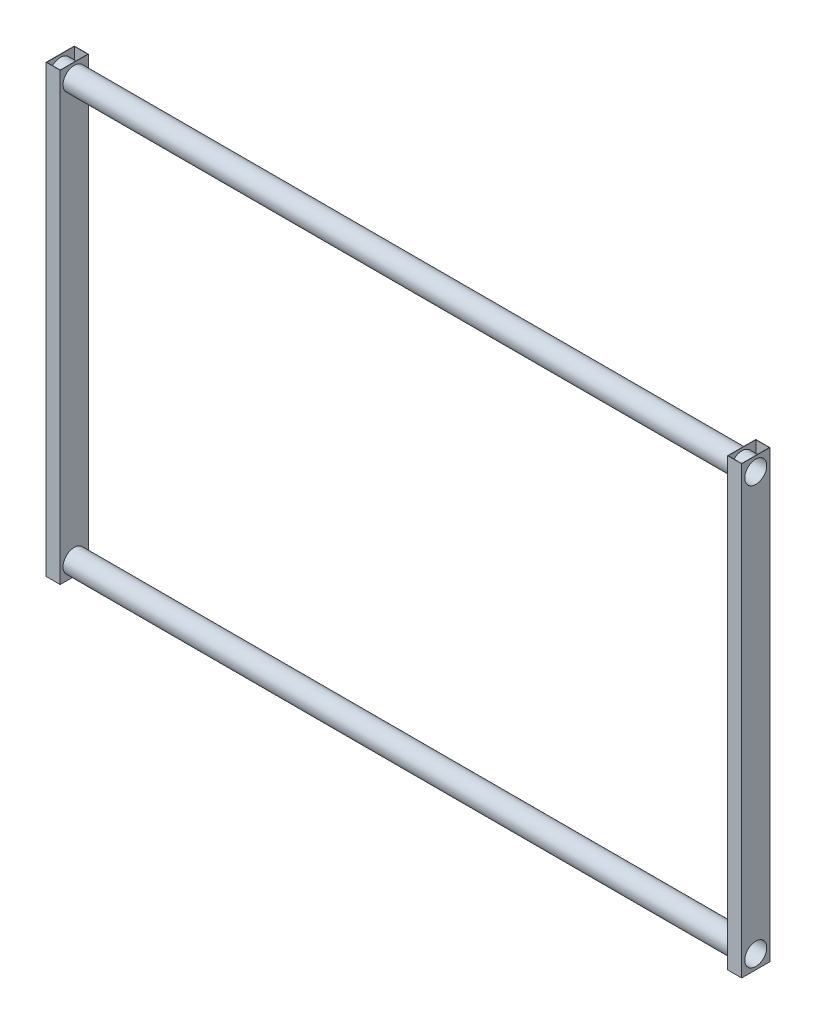
ISO-10303-21;
HEADER;
FILE_DESCRIPTION(('STEP AP214'),'2;1');
FILE_NAME('part.step','',(''),(''),'','','');
FILE_SCHEMA(('AUTOMOTIVE_DESIGN { 1 0 10303 214 1 1 1 1 }'));
ENDSEC;
DATA;
#1=APPLICATION_CONTEXT('core data for automotive mechanical design processes');
#2=APPLICATION_PROTOCOL_DEFINITION('international standard','automotive_design',2000,#1);
#3=PRODUCT_CONTEXT('',#1,'mechanical');
#4=PRODUCT('Part','Part','',(#3));
#5=PRODUCT_RELATED_PRODUCT_CATEGORY('part','',(#4));
#6=PRODUCT_DEFINITION_FORMATION('','',#4);
#7=PRODUCT_DEFINITION_CONTEXT('part definition',#1,'design');
#8=PRODUCT_DEFINITION('design','',#6,#7);
#9=PRODUCT_DEFINITION_SHAPE('','',#8);
#10=(LENGTH_UNIT() NAMED_UNIT(*) SI_UNIT(.MILLI.,.METRE.));
#11=(NAMED_UNIT(*) PLANE_ANGLE_UNIT() SI_UNIT($,.RADIAN.));
#12=(NAMED_UNIT(*) SI_UNIT($,.STERADIAN.) SOLID_ANGLE_UNIT());
#13=UNCERTAINTY_MEASURE_WITH_UNIT(LENGTH_MEASURE(1.E-05),#10,'distance_accuracy_value','');
#14=(GEOMETRIC_REPRESENTATION_CONTEXT(3) GLOBAL_UNCERTAINTY_ASSIGNED_CONTEXT((#13)) GLOBAL_UNIT_ASSIGNED_CONTEXT((#10,
#11,#12)) REPRESENTATION_CONTEXT('',''));
#15=CARTESIAN_POINT('',(0.,0.,0.));
#16=DIRECTION('',(0.,0.,1.));
#17=DIRECTION('',(1.,0.,0.));
#18=AXIS2_PLACEMENT_3D('',#15,#16,#17);
#19=CARTESIAN_POINT('',(-49.5,1600.,-49.5));
#20=DIRECTION('',(1.,0.,0.));
#21=DIRECTION('',(0.,0.,-1.));
#22=AXIS2_PLACEMENT_3D('',#19,#20,#21);
#23=PLANE('',#22);
#24=CARTESIAN_POINT('',(-49.5,50.,-3.36295897620058E-13));
#25=DIRECTION('',(1.,0.,0.));
#26=DIRECTION('',(0.,0.,-1.));
#27=AXIS2_PLACEMENT_3D('',#24,#25,#26);
#28=CIRCLE('',#27,40.5);
#29=CARTESIAN_POINT('',(-49.5,50.,-40.5000000000003));
#30=VERTEX_POINT('',#29);
#31=EDGE_CURVE('E258',#30,#30,#28,.T.);
#32=ORIENTED_EDGE('',*,*,#31,.F.);
#33=EDGE_LOOP('',(#32));
#34=FACE_BOUND('',#33,.T.);
#35=DIRECTION('',(0.,0.,1.));
#36=VECTOR('',#35,1.);
#37=CARTESIAN_POINT('',(-49.5,0.,-49.5));
#38=LINE('',#37,#36);
#39=CARTESIAN_POINT('',(-49.5,0.,-49.5));
#40=VERTEX_POINT('',#39);
#41=CARTESIAN_POINT('',(-49.5,0.,49.5));
#42=VERTEX_POINT('',#41);
#43=EDGE_CURVE('E302',#40,#42,#38,.T.);
#44=ORIENTED_EDGE('',*,*,#43,.F.);
#45=DIRECTION('',(0.,-1.,0.));
#46=VECTOR('',#45,1.);
#47=CARTESIAN_POINT('',(-49.5,1600.,-49.5));
#48=LINE('',#47,#46);
#49=CARTESIAN_POINT('',(-49.5,1600.,-49.5));
#50=VERTEX_POINT('',#49);
#51=EDGE_CURVE('E313',#50,#40,#48,.T.);
#52=ORIENTED_EDGE('',*,*,#51,.F.);
#53=DIRECTION('',(0.,0.,1.));
#54=VECTOR('',#53,1.);
#55=CARTESIAN_POINT('',(-49.5,1600.,-49.5));
#56=LINE('',#55,#54);
#57=CARTESIAN_POINT('',(-49.5,1600.,49.5));
#58=VERTEX_POINT('',#57);
#59=EDGE_CURVE('E289',#50,#58,#56,.T.);
#60=ORIENTED_EDGE('',*,*,#59,.T.);
#61=DIRECTION('',(0.,-1.,0.));
#62=VECTOR('',#61,1.);
#63=CARTESIAN_POINT('',(-49.5,1600.,49.5));
#64=LINE('',#63,#62);
#65=EDGE_CURVE('E55',#58,#42,#64,.T.);
#66=ORIENTED_EDGE('',*,*,#65,.T.);
#67=EDGE_LOOP('',(#44,#52,#60,#66));
#68=FACE_BOUND('',#67,.T.);
#69=CARTESIAN_POINT('',(-49.5,1550.,-3.36295897620058E-13));
#70=DIRECTION('',(1.,0.,0.));
#71=DIRECTION('',(0.,0.,-1.));
#72=AXIS2_PLACEMENT_3D('',#69,#70,#71);
#73=CIRCLE('',#72,40.5);
#74=CARTESIAN_POINT('',(-49.5,1550.,-40.5000000000003));
#75=VERTEX_POINT('',#74);
#76=EDGE_CURVE('E518',#75,#75,#73,.T.);
#77=ORIENTED_EDGE('',*,*,#76,.F.);
#78=EDGE_LOOP('',(#77));
#79=FACE_BOUND('',#78,.T.);
#80=ADVANCED_FACE('F39',(#34,#68,#79),#23,.T.);
#81=CARTESIAN_POINT('',(2447.5,1600.,-49.5000000000003));
#82=DIRECTION('',(-1.,0.,0.));
#83=DIRECTION('',(0.,0.,1.));
#84=AXIS2_PLACEMENT_3D('',#81,#82,#83);
#85=PLANE('',#84);
#86=DIRECTION('',(0.,0.,-1.));
#87=VECTOR('',#86,1.);
#88=CARTESIAN_POINT('',(2447.5,0.,-49.5000000000003));
#89=LINE('',#88,#87);
#90=CARTESIAN_POINT('',(2447.5,0.,49.5000000000003));
#91=VERTEX_POINT('',#90);
#92=CARTESIAN_POINT('',(2447.5,0.,-49.5000000000003));
#93=VERTEX_POINT('',#92);
#94=EDGE_CURVE('E175',#91,#93,#89,.T.);
#95=ORIENTED_EDGE('',*,*,#94,.F.);
#96=DIRECTION('',(0.,-1.,0.));
#97=VECTOR('',#96,1.);
#98=CARTESIAN_POINT('',(2447.5,1600.,49.5000000000003));
#99=LINE('',#98,#97);
#100=CARTESIAN_POINT('',(2447.5,1600.,49.5000000000003));
#101=VERTEX_POINT('',#100);
#102=EDGE_CURVE('E159',#101,#91,#99,.T.);
#103=ORIENTED_EDGE('',*,*,#102,.F.);
#104=DIRECTION('',(0.,0.,-1.));
#105=VECTOR('',#104,1.);
#106=CARTESIAN_POINT('',(2447.5,1600.,-49.5000000000003));
#107=LINE('',#106,#105);
#108=CARTESIAN_POINT('',(2447.5,1600.,-49.5000000000003));
#109=VERTEX_POINT('',#108);
#110=EDGE_CURVE('E167',#101,#109,#107,.T.);
#111=ORIENTED_EDGE('',*,*,#110,.T.);
#112=DIRECTION('',(0.,-1.,0.));
#113=VECTOR('',#112,1.);
#114=CARTESIAN_POINT('',(2447.5,1600.,-49.5000000000003));
#115=LINE('',#114,#113);
#116=EDGE_CURVE('E178',#109,#93,#115,.T.);
#117=ORIENTED_EDGE('',*,*,#116,.T.);
#118=EDGE_LOOP('',(#95,#103,#111,#117));
#119=FACE_BOUND('',#118,.T.);
#120=CARTESIAN_POINT('',(2447.5,50.,-3.36295897620058E-13));
#121=DIRECTION('',(-1.,0.,0.));
#122=DIRECTION('',(0.,0.,1.));
#123=AXIS2_PLACEMENT_3D('',#120,#121,#122);
#124=CIRCLE('',#123,40.5);
#125=CARTESIAN_POINT('',(2447.5,50.,40.4999999999997));
#126=VERTEX_POINT('',#125);
#127=EDGE_CURVE('E254',#126,#126,#124,.T.);
#128=ORIENTED_EDGE('',*,*,#127,.F.);
#129=EDGE_LOOP('',(#128));
#130=FACE_BOUND('',#129,.T.);
#131=CARTESIAN_POINT('',(2447.5,1550.,-3.36295897620058E-13));
#132=DIRECTION('',(-1.,0.,0.));
#133=DIRECTION('',(0.,0.,1.));
#134=AXIS2_PLACEMENT_3D('',#131,#132,#133);
#135=CIRCLE('',#134,40.5);
#136=CARTESIAN_POINT('',(2447.5,1550.,40.4999999999996));
#137=VERTEX_POINT('',#136);
#138=EDGE_CURVE('E517',#137,#137,#135,.T.);
#139=ORIENTED_EDGE('',*,*,#138,.F.);
#140=EDGE_LOOP('',(#139));
#141=FACE_BOUND('',#140,.T.);
#142=ADVANCED_FACE('F171',(#119,#130,#141),#85,.T.);
#143=CARTESIAN_POINT('',(-164.05129855222,50.,-3.36295897620058E-13));
#144=DIRECTION('',(1.,0.,0.));
#145=DIRECTION('',(0.,0.,-1.));
#146=AXIS2_PLACEMENT_3D('',#143,#144,#145);
#147=CYLINDRICAL_SURFACE('',#146,40.5);
#148=CARTESIAN_POINT('',(0.,50.,0.));
#149=DIRECTION('',(1.,0.,0.));
#150=DIRECTION('',(0.,0.,-1.));
#151=AXIS2_PLACEMENT_3D('',#148,#149,#150);
#152=CIRCLE('',#151,40.5);
#153=CARTESIAN_POINT('',(0.,50.,-40.5));
#154=VERTEX_POINT('',#153);
#155=EDGE_CURVE('E267',#154,#154,#152,.T.);
#156=ORIENTED_EDGE('',*,*,#155,.T.);
#157=EDGE_LOOP('',(#156));
#158=FACE_BOUND('',#157,.T.);
#159=CARTESIAN_POINT('',(2398.,50.,-3.36295897620058E-13));
#160=DIRECTION('',(1.,0.,0.));
#161=DIRECTION('',(0.,0.,-1.));
#162=AXIS2_PLACEMENT_3D('',#159,#160,#161);
#163=CIRCLE('',#162,40.5);
#164=CARTESIAN_POINT('',(2398.,50.,-40.5000000000003));
#165=VERTEX_POINT('',#164);
#166=EDGE_CURVE('E11',#165,#165,#163,.T.);
#167=ORIENTED_EDGE('',*,*,#166,.F.);
#168=EDGE_LOOP('',(#167));
#169=FACE_BOUND('',#168,.T.);
#170=ADVANCED_FACE('F382',(#158,#169),#147,.T.);
#171=CARTESIAN_POINT('',(0.,1600.,0.));
#172=DIRECTION('',(0.,-1.,0.));
#173=DIRECTION('',(0.,0.,-1.));
#174=AXIS2_PLACEMENT_3D('',#171,#172,#173);
#175=PLANE('',#174);
#176=DIRECTION('',(0.,0.,-1.));
#177=VECTOR('',#176,1.);
#178=CARTESIAN_POINT('',(0.,1600.,-50.5));
#179=LINE('',#178,#177);
#180=CARTESIAN_POINT('',(0.,1600.,50.5));
#181=VERTEX_POINT('',#180);
#182=CARTESIAN_POINT('',(0.,1600.,-50.5));
#183=VERTEX_POINT('',#182);
#184=EDGE_CURVE('E320',#181,#183,#179,.T.);
#185=ORIENTED_EDGE('',*,*,#184,.T.);
#186=DIRECTION('',(-1.,0.,0.));
#187=VECTOR('',#186,1.);
#188=CARTESIAN_POINT('',(0.,1600.,-50.5));
#189=LINE('',#188,#187);
#190=CARTESIAN_POINT('',(-50.5,1600.,-50.5));
#191=VERTEX_POINT('',#190);
#192=EDGE_CURVE('E324',#183,#191,#189,.T.);
#193=ORIENTED_EDGE('',*,*,#192,.T.);
#194=DIRECTION('',(0.,0.,1.));
#195=VECTOR('',#194,1.);
#196=CARTESIAN_POINT('',(-50.5,1600.,-50.5));
#197=LINE('',#196,#195);
#198=CARTESIAN_POINT('',(-50.5,1600.,50.5));
#199=VERTEX_POINT('',#198);
#200=EDGE_CURVE('E328',#191,#199,#197,.T.);
#201=ORIENTED_EDGE('',*,*,#200,.T.);
#202=DIRECTION('',(1.,0.,0.));
#203=VECTOR('',#202,1.);
#204=CARTESIAN_POINT('',(0.,1600.,50.5));
#205=LINE('',#204,#203);
#206=EDGE_CURVE('E331',#199,#181,#205,.T.);
#207=ORIENTED_EDGE('',*,*,#206,.T.);
#208=EDGE_LOOP('',(#185,#193,#201,#207));
#209=FACE_BOUND('',#208,.T.);
#210=DIRECTION('',(0.,0.,-1.));
#211=VECTOR('',#210,1.);
#212=CARTESIAN_POINT('',(-1.00000000000002,1600.,-49.5));
#213=LINE('',#212,#211);
#214=CARTESIAN_POINT('',(-1.00000000000002,1600.,49.5));
#215=VERTEX_POINT('',#214);
#216=CARTESIAN_POINT('',(-1.00000000000002,1600.,-49.5));
#217=VERTEX_POINT('',#216);
#218=EDGE_CURVE('E282',#215,#217,#213,.T.);
#219=ORIENTED_EDGE('',*,*,#218,.F.);
#220=DIRECTION('',(1.,0.,0.));
#221=VECTOR('',#220,1.);
#222=CARTESIAN_POINT('',(-1.00000000000002,1600.,49.5));
#223=LINE('',#222,#221);
#224=EDGE_CURVE('E292',#58,#215,#223,.T.);
#225=ORIENTED_EDGE('',*,*,#224,.F.);
#226=ORIENTED_EDGE('',*,*,#59,.F.);
#227=DIRECTION('',(-1.,0.,0.));
#228=VECTOR('',#227,1.);
#229=CARTESIAN_POINT('',(-1.00000000000002,1600.,-49.5));
#230=LINE('',#229,#228);
#231=EDGE_CURVE('E285',#217,#50,#230,.T.);
#232=ORIENTED_EDGE('',*,*,#231,.F.);
#233=EDGE_LOOP('',(#219,#225,#226,#232));
#234=FACE_BOUND('',#233,.T.);
#235=ADVANCED_FACE('F379',(#209,#234),#175,.F.);
#236=CARTESIAN_POINT('',(0.,0.,0.));
#237=DIRECTION('',(0.,-1.,0.));
#238=DIRECTION('',(0.,0.,-1.));
#239=AXIS2_PLACEMENT_3D('',#236,#237,#238);
#240=PLANE('',#239);
#241=DIRECTION('',(0.,0.,-1.));
#242=VECTOR('',#241,1.);
#243=CARTESIAN_POINT('',(0.,0.,-50.5));
#244=LINE('',#243,#242);
#245=CARTESIAN_POINT('',(0.,0.,50.5));
#246=VERTEX_POINT('',#245);
#247=CARTESIAN_POINT('',(0.,0.,-50.5));
#248=VERTEX_POINT('',#247);
#249=EDGE_CURVE('E319',#246,#248,#244,.T.);
#250=ORIENTED_EDGE('',*,*,#249,.F.);
#251=DIRECTION('',(1.,0.,0.));
#252=VECTOR('',#251,1.);
#253=CARTESIAN_POINT('',(0.,0.,50.5));
#254=LINE('',#253,#252);
#255=CARTESIAN_POINT('',(-50.5,0.,50.5));
#256=VERTEX_POINT('',#255);
#257=EDGE_CURVE('E325',#256,#246,#254,.T.);
#258=ORIENTED_EDGE('',*,*,#257,.F.);
#259=DIRECTION('',(0.,0.,1.));
#260=VECTOR('',#259,1.);
#261=CARTESIAN_POINT('',(-50.5,0.,-50.5));
#262=LINE('',#261,#260);
#263=CARTESIAN_POINT('',(-50.5,0.,-50.5));
#264=VERTEX_POINT('',#263);
#265=EDGE_CURVE('E341',#264,#256,#262,.T.);
#266=ORIENTED_EDGE('',*,*,#265,.F.);
#267=DIRECTION('',(-1.,0.,0.));
#268=VECTOR('',#267,1.);
#269=CARTESIAN_POINT('',(0.,0.,-50.5));
#270=LINE('',#269,#268);
#271=EDGE_CURVE('E338',#248,#264,#270,.T.);
#272=ORIENTED_EDGE('',*,*,#271,.F.);
#273=EDGE_LOOP('',(#250,#258,#266,#272));
#274=FACE_BOUND('',#273,.T.);
#275=DIRECTION('',(1.,0.,0.));
#276=VECTOR('',#275,1.);
#277=CARTESIAN_POINT('',(-1.00000000000002,0.,49.5));
#278=LINE('',#277,#276);
#279=CARTESIAN_POINT('',(-1.00000000000002,0.,49.5));
#280=VERTEX_POINT('',#279);
#281=EDGE_CURVE('E286',#42,#280,#278,.T.);
#282=ORIENTED_EDGE('',*,*,#281,.T.);
#283=DIRECTION('',(0.,0.,-1.));
#284=VECTOR('',#283,1.);
#285=CARTESIAN_POINT('',(-1.00000000000002,0.,-49.5));
#286=LINE('',#285,#284);
#287=CARTESIAN_POINT('',(-1.00000000000002,0.,-49.5));
#288=VERTEX_POINT('',#287);
#289=EDGE_CURVE('E63',#280,#288,#286,.T.);
#290=ORIENTED_EDGE('',*,*,#289,.T.);
#291=DIRECTION('',(-1.,0.,0.));
#292=VECTOR('',#291,1.);
#293=CARTESIAN_POINT('',(-1.00000000000002,0.,-49.5));
#294=LINE('',#293,#292);
#295=EDGE_CURVE('E298',#288,#40,#294,.T.);
#296=ORIENTED_EDGE('',*,*,#295,.T.);
#297=ORIENTED_EDGE('',*,*,#43,.T.);
#298=EDGE_LOOP('',(#282,#290,#296,#297));
#299=FACE_BOUND('',#298,.T.);
#300=ADVANCED_FACE('F368',(#274,#299),#240,.T.);
#301=CARTESIAN_POINT('',(0.,1600.,-50.5));
#302=DIRECTION('',(-1.,0.,0.));
#303=DIRECTION('',(0.,0.,1.));
#304=AXIS2_PLACEMENT_3D('',#301,#302,#303);
#305=PLANE('',#304);
#306=ORIENTED_EDGE('',*,*,#155,.F.);
#307=EDGE_LOOP('',(#306));
#308=FACE_BOUND('',#307,.T.);
#309=CARTESIAN_POINT('',(0.,1550.,0.));
#310=DIRECTION('',(1.,0.,0.));
#311=DIRECTION('',(0.,0.,-1.));
#312=AXIS2_PLACEMENT_3D('',#309,#310,#311);
#313=CIRCLE('',#312,40.5);
#314=CARTESIAN_POINT('',(0.,1550.,-40.5));
#315=VERTEX_POINT('',#314);
#316=EDGE_CURVE('E266',#315,#315,#313,.T.);
#317=ORIENTED_EDGE('',*,*,#316,.F.);
#318=EDGE_LOOP('',(#317));
#319=FACE_BOUND('',#318,.T.);
#320=ORIENTED_EDGE('',*,*,#249,.T.);
#321=DIRECTION('',(0.,-1.,0.));
#322=VECTOR('',#321,1.);
#323=CARTESIAN_POINT('',(0.,1600.,-50.5));
#324=LINE('',#323,#322);
#325=EDGE_CURVE('E48',#183,#248,#324,.T.);
#326=ORIENTED_EDGE('',*,*,#325,.F.);
#327=ORIENTED_EDGE('',*,*,#184,.F.);
#328=DIRECTION('',(0.,-1.,0.));
#329=VECTOR('',#328,1.);
#330=CARTESIAN_POINT('',(0.,1600.,50.5));
#331=LINE('',#330,#329);
#332=EDGE_CURVE('E334',#181,#246,#331,.T.);
#333=ORIENTED_EDGE('',*,*,#332,.T.);
#334=EDGE_LOOP('',(#320,#326,#327,#333));
#335=FACE_BOUND('',#334,.T.);
#336=ADVANCED_FACE('F41',(#308,#319,#335),#305,.F.);
#337=CARTESIAN_POINT('',(0.,1600.,-50.5));
#338=DIRECTION('',(0.,0.,1.));
#339=DIRECTION('',(1.,0.,0.));
#340=AXIS2_PLACEMENT_3D('',#337,#338,#339);
#341=PLANE('',#340);
#342=ORIENTED_EDGE('',*,*,#271,.T.);
#343=DIRECTION('',(0.,-1.,0.));
#344=VECTOR('',#343,1.);
#345=CARTESIAN_POINT('',(-50.5,1600.,-50.5));
#346=LINE('',#345,#344);
#347=EDGE_CURVE('E353',#191,#264,#346,.T.);
#348=ORIENTED_EDGE('',*,*,#347,.F.);
#349=ORIENTED_EDGE('',*,*,#192,.F.);
#350=ORIENTED_EDGE('',*,*,#325,.T.);
#351=EDGE_LOOP('',(#342,#348,#349,#350));
#352=FACE_BOUND('',#351,.T.);
#353=ADVANCED_FACE('F360',(#352),#341,.F.);
#354=CARTESIAN_POINT('',(-50.5,1600.,-50.5));
#355=DIRECTION('',(1.,0.,0.));
#356=DIRECTION('',(0.,0.,-1.));
#357=AXIS2_PLACEMENT_3D('',#354,#355,#356);
#358=PLANE('',#357);
#359=CARTESIAN_POINT('',(-50.5,50.,0.));
#360=DIRECTION('',(-1.,0.,0.));
#361=DIRECTION('',(0.,0.,1.));
#362=AXIS2_PLACEMENT_3D('',#359,#360,#361);
#363=CIRCLE('',#362,39.5);
#364=CARTESIAN_POINT('',(-50.5,50.,39.5));
#365=VERTEX_POINT('',#364);
#366=EDGE_CURVE('E275',#365,#365,#363,.T.);
#367=ORIENTED_EDGE('',*,*,#366,.F.);
#368=EDGE_LOOP('',(#367));
#369=FACE_BOUND('',#368,.T.);
#370=CARTESIAN_POINT('',(-50.5,1550.,0.));
#371=DIRECTION('',(-1.,0.,0.));
#372=DIRECTION('',(0.,0.,1.));
#373=AXIS2_PLACEMENT_3D('',#370,#371,#372);
#374=CIRCLE('',#373,39.5);
#375=CARTESIAN_POINT('',(-50.5,1550.,39.5));
#376=VERTEX_POINT('',#375);
#377=EDGE_CURVE('E271',#376,#376,#374,.T.);
#378=ORIENTED_EDGE('',*,*,#377,.F.);
#379=EDGE_LOOP('',(#378));
#380=FACE_BOUND('',#379,.T.);
#381=ORIENTED_EDGE('',*,*,#265,.T.);
#382=DIRECTION('',(0.,-1.,0.));
#383=VECTOR('',#382,1.);
#384=CARTESIAN_POINT('',(-50.5,1600.,50.5));
#385=LINE('',#384,#383);
#386=EDGE_CURVE('E349',#199,#256,#385,.T.);
#387=ORIENTED_EDGE('',*,*,#386,.F.);
#388=ORIENTED_EDGE('',*,*,#200,.F.);
#389=ORIENTED_EDGE('',*,*,#347,.T.);
#390=EDGE_LOOP('',(#381,#387,#388,#389));
#391=FACE_BOUND('',#390,.T.);
#392=ADVANCED_FACE('F373',(#369,#380,#391),#358,.F.);
#393=CARTESIAN_POINT('',(0.,1600.,50.5));
#394=DIRECTION('',(0.,0.,-1.));
#395=DIRECTION('',(-1.,0.,0.));
#396=AXIS2_PLACEMENT_3D('',#393,#394,#395);
#397=PLANE('',#396);
#398=ORIENTED_EDGE('',*,*,#257,.T.);
#399=ORIENTED_EDGE('',*,*,#332,.F.);
#400=ORIENTED_EDGE('',*,*,#206,.F.);
#401=ORIENTED_EDGE('',*,*,#386,.T.);
#402=EDGE_LOOP('',(#398,#399,#400,#401));
#403=FACE_BOUND('',#402,.T.);
#404=ADVANCED_FACE('F377',(#403),#397,.F.);
#405=CARTESIAN_POINT('',(-1.00000000000002,1600.,-49.5));
#406=DIRECTION('',(-1.,0.,0.));
#407=DIRECTION('',(0.,0.,1.));
#408=AXIS2_PLACEMENT_3D('',#405,#406,#407);
#409=PLANE('',#408);
#410=CARTESIAN_POINT('',(-1.00000000000003,50.,-3.36295897620058E-13));
#411=DIRECTION('',(-1.,0.,0.));
#412=DIRECTION('',(0.,0.,1.));
#413=AXIS2_PLACEMENT_3D('',#410,#411,#412);
#414=CIRCLE('',#413,40.5);
#415=CARTESIAN_POINT('',(-1.00000000000003,50.,40.4999999999997));
#416=VERTEX_POINT('',#415);
#417=EDGE_CURVE('E262',#416,#416,#414,.F.);
#418=ORIENTED_EDGE('',*,*,#417,.T.);
#419=EDGE_LOOP('',(#418));
#420=FACE_BOUND('',#419,.T.);
#421=CARTESIAN_POINT('',(-1.00000000000003,1550.,-3.36295897620058E-13));
#422=DIRECTION('',(-1.,0.,0.));
#423=DIRECTION('',(0.,0.,1.));
#424=AXIS2_PLACEMENT_3D('',#421,#422,#423);
#425=CIRCLE('',#424,40.5);
#426=CARTESIAN_POINT('',(-1.00000000000003,1550.,40.4999999999996));
#427=VERTEX_POINT('',#426);
#428=EDGE_CURVE('E506',#427,#427,#425,.F.);
#429=ORIENTED_EDGE('',*,*,#428,.T.);
#430=EDGE_LOOP('',(#429));
#431=FACE_BOUND('',#430,.T.);
#432=ORIENTED_EDGE('',*,*,#289,.F.);
#433=DIRECTION('',(0.,-1.,0.));
#434=VECTOR('',#433,1.);
#435=CARTESIAN_POINT('',(-1.00000000000002,1600.,49.5));
#436=LINE('',#435,#434);
#437=EDGE_CURVE('E295',#215,#280,#436,.T.);
#438=ORIENTED_EDGE('',*,*,#437,.F.);
#439=ORIENTED_EDGE('',*,*,#218,.T.);
#440=DIRECTION('',(0.,-1.,0.));
#441=VECTOR('',#440,1.);
#442=CARTESIAN_POINT('',(-1.00000000000002,1600.,-49.5));
#443=LINE('',#442,#441);
#444=EDGE_CURVE('E316',#217,#288,#443,.T.);
#445=ORIENTED_EDGE('',*,*,#444,.T.);
#446=EDGE_LOOP('',(#432,#438,#439,#445));
#447=FACE_BOUND('',#446,.T.);
#448=ADVANCED_FACE('F389',(#420,#431,#447),#409,.T.);
#449=CARTESIAN_POINT('',(-1.00000000000002,1600.,-49.5));
#450=DIRECTION('',(0.,0.,1.));
#451=DIRECTION('',(1.,0.,0.));
#452=AXIS2_PLACEMENT_3D('',#449,#450,#451);
#453=PLANE('',#452);
#454=ORIENTED_EDGE('',*,*,#295,.F.);
#455=ORIENTED_EDGE('',*,*,#444,.F.);
#456=ORIENTED_EDGE('',*,*,#231,.T.);
#457=ORIENTED_EDGE('',*,*,#51,.T.);
#458=EDGE_LOOP('',(#454,#455,#456,#457));
#459=FACE_BOUND('',#458,.T.);
#460=ADVANCED_FACE('F391',(#459),#453,.T.);
#461=CARTESIAN_POINT('',(-1.00000000000002,1600.,49.5));
#462=DIRECTION('',(0.,0.,-1.));
#463=DIRECTION('',(-1.,0.,0.));
#464=AXIS2_PLACEMENT_3D('',#461,#462,#463);
#465=PLANE('',#464);
#466=ORIENTED_EDGE('',*,*,#281,.F.);
#467=ORIENTED_EDGE('',*,*,#65,.F.);
#468=ORIENTED_EDGE('',*,*,#224,.T.);
#469=ORIENTED_EDGE('',*,*,#437,.T.);
#470=EDGE_LOOP('',(#466,#467,#468,#469));
#471=FACE_BOUND('',#470,.T.);
#472=ADVANCED_FACE('F394',(#471),#465,.T.);
#473=CARTESIAN_POINT('',(2448.5,1550.,-3.3643330145974E-13));
#474=DIRECTION('',(-1.,0.,0.));
#475=DIRECTION('',(0.,0.,1.));
#476=AXIS2_PLACEMENT_3D('',#473,#474,#475);
#477=CYLINDRICAL_SURFACE('',#476,39.5);
#478=ORIENTED_EDGE('',*,*,#377,.T.);
#479=EDGE_LOOP('',(#478));
#480=FACE_BOUND('',#479,.T.);
#481=CARTESIAN_POINT('',(2448.5,1550.,-3.3643330145974E-13));
#482=DIRECTION('',(-1.,0.,0.));
#483=DIRECTION('',(0.,0.,1.));
#484=AXIS2_PLACEMENT_3D('',#481,#482,#483);
#485=CIRCLE('',#484,39.5);
#486=CARTESIAN_POINT('',(2448.5,1550.,39.4999999999996));
#487=VERTEX_POINT('',#486);
#488=EDGE_CURVE('E497',#487,#487,#485,.T.);
#489=ORIENTED_EDGE('',*,*,#488,.F.);
#490=EDGE_LOOP('',(#489));
#491=FACE_BOUND('',#490,.T.);
#492=ADVANCED_FACE('F396',(#480,#491),#477,.F.);
#493=CARTESIAN_POINT('',(2448.5,50.,-3.3643330145974E-13));
#494=DIRECTION('',(-1.,0.,0.));
#495=DIRECTION('',(0.,0.,1.));
#496=AXIS2_PLACEMENT_3D('',#493,#494,#495);
#497=CYLINDRICAL_SURFACE('',#496,39.5);
#498=ORIENTED_EDGE('',*,*,#366,.T.);
#499=EDGE_LOOP('',(#498));
#500=FACE_BOUND('',#499,.T.);
#501=CARTESIAN_POINT('',(2448.5,50.,-3.3643330145974E-13));
#502=DIRECTION('',(-1.,0.,0.));
#503=DIRECTION('',(0.,0.,1.));
#504=AXIS2_PLACEMENT_3D('',#501,#502,#503);
#505=CIRCLE('',#504,39.5);
#506=CARTESIAN_POINT('',(2448.5,50.,39.4999999999997));
#507=VERTEX_POINT('',#506);
#508=EDGE_CURVE('E196',#507,#507,#505,.T.);
#509=ORIENTED_EDGE('',*,*,#508,.F.);
#510=EDGE_LOOP('',(#509));
#511=FACE_BOUND('',#510,.T.);
#512=ADVANCED_FACE('F402',(#500,#511),#497,.F.);
#513=ORIENTED_EDGE('',*,*,#417,.F.);
#514=EDGE_LOOP('',(#513));
#515=FACE_BOUND('',#514,.T.);
#516=ORIENTED_EDGE('',*,*,#31,.T.);
#517=EDGE_LOOP('',(#516));
#518=FACE_BOUND('',#517,.T.);
#519=ADVANCED_FACE('F465',(#515,#518),#147,.T.);
#520=CARTESIAN_POINT('',(0.,1600.,0.));
#521=DIRECTION('',(0.,1.,0.));
#522=DIRECTION('',(0.,0.,1.));
#523=AXIS2_PLACEMENT_3D('',#520,#521,#522);
#524=PLANE('',#523);
#525=DIRECTION('',(0.,0.,1.));
#526=VECTOR('',#525,1.);
#527=CARTESIAN_POINT('',(2398.,1600.,-50.4999999999997));
#528=LINE('',#527,#526);
#529=CARTESIAN_POINT('',(2398.,1600.,-50.4999999999997));
#530=VERTEX_POINT('',#529);
#531=CARTESIAN_POINT('',(2398.,1600.,50.4999999999997));
#532=VERTEX_POINT('',#531);
#533=EDGE_CURVE('E213',#530,#532,#528,.T.);
#534=ORIENTED_EDGE('',*,*,#533,.T.);
#535=DIRECTION('',(1.,0.,0.));
#536=VECTOR('',#535,1.);
#537=CARTESIAN_POINT('',(2398.,1600.,50.4999999999997));
#538=LINE('',#537,#536);
#539=CARTESIAN_POINT('',(2448.5,1600.,50.4999999999997));
#540=VERTEX_POINT('',#539);
#541=EDGE_CURVE('E217',#532,#540,#538,.T.);
#542=ORIENTED_EDGE('',*,*,#541,.T.);
#543=DIRECTION('',(0.,0.,-1.));
#544=VECTOR('',#543,1.);
#545=CARTESIAN_POINT('',(2448.5,1600.,-50.4999999999997));
#546=LINE('',#545,#544);
#547=CARTESIAN_POINT('',(2448.5,1600.,-50.4999999999997));
#548=VERTEX_POINT('',#547);
#549=EDGE_CURVE('E221',#540,#548,#546,.T.);
#550=ORIENTED_EDGE('',*,*,#549,.T.);
#551=DIRECTION('',(-1.,0.,0.));
#552=VECTOR('',#551,1.);
#553=CARTESIAN_POINT('',(2398.,1600.,-50.4999999999997));
#554=LINE('',#553,#552);
#555=EDGE_CURVE('E224',#548,#530,#554,.T.);
#556=ORIENTED_EDGE('',*,*,#555,.T.);
#557=EDGE_LOOP('',(#534,#542,#550,#556));
#558=FACE_BOUND('',#557,.T.);
#559=ORIENTED_EDGE('',*,*,#110,.F.);
#560=DIRECTION('',(1.,0.,0.));
#561=VECTOR('',#560,1.);
#562=CARTESIAN_POINT('',(2399.,1600.,49.5000000000003));
#563=LINE('',#562,#561);
#564=CARTESIAN_POINT('',(2399.,1600.,49.5000000000003));
#565=VERTEX_POINT('',#564);
#566=EDGE_CURVE('E156',#565,#101,#563,.T.);
#567=ORIENTED_EDGE('',*,*,#566,.F.);
#568=DIRECTION('',(0.,0.,1.));
#569=VECTOR('',#568,1.);
#570=CARTESIAN_POINT('',(2399.,1600.,-49.5000000000003));
#571=LINE('',#570,#569);
#572=CARTESIAN_POINT('',(2399.,1600.,-49.5000000000003));
#573=VERTEX_POINT('',#572);
#574=EDGE_CURVE('E187',#573,#565,#571,.T.);
#575=ORIENTED_EDGE('',*,*,#574,.F.);
#576=DIRECTION('',(-1.,0.,0.));
#577=VECTOR('',#576,1.);
#578=CARTESIAN_POINT('',(2399.,1600.,-49.5000000000003));
#579=LINE('',#578,#577);
#580=EDGE_CURVE('E183',#109,#573,#579,.T.);
#581=ORIENTED_EDGE('',*,*,#580,.F.);
#582=EDGE_LOOP('',(#559,#567,#575,#581));
#583=FACE_BOUND('',#582,.T.);
#584=ADVANCED_FACE('F181',(#558,#583),#524,.T.);
#585=CARTESIAN_POINT('',(0.,0.,0.));
#586=DIRECTION('',(0.,1.,0.));
#587=DIRECTION('',(0.,0.,1.));
#588=AXIS2_PLACEMENT_3D('',#585,#586,#587);
#589=PLANE('',#588);
#590=DIRECTION('',(0.,0.,1.));
#591=VECTOR('',#590,1.);
#592=CARTESIAN_POINT('',(2398.,0.,-50.4999999999997));
#593=LINE('',#592,#591);
#594=CARTESIAN_POINT('',(2398.,0.,-50.4999999999997));
#595=VERTEX_POINT('',#594);
#596=CARTESIAN_POINT('',(2398.,0.,50.4999999999997));
#597=VERTEX_POINT('',#596);
#598=EDGE_CURVE('E177',#595,#597,#593,.T.);
#599=ORIENTED_EDGE('',*,*,#598,.F.);
#600=DIRECTION('',(-1.,0.,0.));
#601=VECTOR('',#600,1.);
#602=CARTESIAN_POINT('',(2398.,0.,-50.4999999999997));
#603=LINE('',#602,#601);
#604=CARTESIAN_POINT('',(2448.5,0.,-50.4999999999997));
#605=VERTEX_POINT('',#604);
#606=EDGE_CURVE('E218',#605,#595,#603,.T.);
#607=ORIENTED_EDGE('',*,*,#606,.F.);
#608=DIRECTION('',(0.,0.,-1.));
#609=VECTOR('',#608,1.);
#610=CARTESIAN_POINT('',(2448.5,0.,-50.4999999999997));
#611=LINE('',#610,#609);
#612=CARTESIAN_POINT('',(2448.5,0.,50.4999999999997));
#613=VERTEX_POINT('',#612);
#614=EDGE_CURVE('E234',#613,#605,#611,.T.);
#615=ORIENTED_EDGE('',*,*,#614,.F.);
#616=DIRECTION('',(1.,0.,0.));
#617=VECTOR('',#616,1.);
#618=CARTESIAN_POINT('',(2398.,0.,50.4999999999997));
#619=LINE('',#618,#617);
#620=EDGE_CURVE('E231',#597,#613,#619,.T.);
#621=ORIENTED_EDGE('',*,*,#620,.F.);
#622=EDGE_LOOP('',(#599,#607,#615,#621));
#623=FACE_BOUND('',#622,.T.);
#624=DIRECTION('',(1.,0.,0.));
#625=VECTOR('',#624,1.);
#626=CARTESIAN_POINT('',(2399.,0.,49.5000000000003));
#627=LINE('',#626,#625);
#628=CARTESIAN_POINT('',(2399.,0.,49.5000000000003));
#629=VERTEX_POINT('',#628);
#630=EDGE_CURVE('E193',#629,#91,#627,.T.);
#631=ORIENTED_EDGE('',*,*,#630,.T.);
#632=ORIENTED_EDGE('',*,*,#94,.T.);
#633=DIRECTION('',(-1.,0.,0.));
#634=VECTOR('',#633,1.);
#635=CARTESIAN_POINT('',(2399.,0.,-49.5000000000003));
#636=LINE('',#635,#634);
#637=CARTESIAN_POINT('',(2399.,0.,-49.5000000000003));
#638=VERTEX_POINT('',#637);
#639=EDGE_CURVE('E199',#93,#638,#636,.T.);
#640=ORIENTED_EDGE('',*,*,#639,.T.);
#641=DIRECTION('',(0.,0.,1.));
#642=VECTOR('',#641,1.);
#643=CARTESIAN_POINT('',(2399.,0.,-49.5000000000003));
#644=LINE('',#643,#642);
#645=EDGE_CURVE('E168',#638,#629,#644,.T.);
#646=ORIENTED_EDGE('',*,*,#645,.T.);
#647=EDGE_LOOP('',(#631,#632,#640,#646));
#648=FACE_BOUND('',#647,.T.);
#649=ADVANCED_FACE('F464',(#623,#648),#589,.F.);
#650=CARTESIAN_POINT('',(2398.,1600.,-50.4999999999997));
#651=DIRECTION('',(1.,0.,0.));
#652=DIRECTION('',(0.,0.,-1.));
#653=AXIS2_PLACEMENT_3D('',#650,#651,#652);
#654=PLANE('',#653);
#655=ORIENTED_EDGE('',*,*,#166,.T.);
#656=EDGE_LOOP('',(#655));
#657=FACE_BOUND('',#656,.T.);
#658=CARTESIAN_POINT('',(2398.,1550.,-3.29494407555832E-13));
#659=DIRECTION('',(-1.,0.,0.));
#660=DIRECTION('',(0.,0.,1.));
#661=AXIS2_PLACEMENT_3D('',#658,#659,#660);
#662=CIRCLE('',#661,40.5);
#663=CARTESIAN_POINT('',(2398.,1550.,40.4999999999997));
#664=VERTEX_POINT('',#663);
#665=EDGE_CURVE('E503',#664,#664,#662,.T.);
#666=ORIENTED_EDGE('',*,*,#665,.F.);
#667=EDGE_LOOP('',(#666));
#668=FACE_BOUND('',#667,.T.);
#669=ORIENTED_EDGE('',*,*,#598,.T.);
#670=DIRECTION('',(0.,-1.,0.));
#671=VECTOR('',#670,1.);
#672=CARTESIAN_POINT('',(2398.,1600.,50.4999999999997));
#673=LINE('',#672,#671);
#674=EDGE_CURVE('E250',#532,#597,#673,.T.);
#675=ORIENTED_EDGE('',*,*,#674,.F.);
#676=ORIENTED_EDGE('',*,*,#533,.F.);
#677=DIRECTION('',(0.,-1.,0.));
#678=VECTOR('',#677,1.);
#679=CARTESIAN_POINT('',(2398.,1600.,-50.4999999999997));
#680=LINE('',#679,#678);
#681=EDGE_CURVE('E227',#530,#595,#680,.T.);
#682=ORIENTED_EDGE('',*,*,#681,.T.);
#683=EDGE_LOOP('',(#669,#675,#676,#682));
#684=FACE_BOUND('',#683,.T.);
#685=ADVANCED_FACE('F469',(#657,#668,#684),#654,.F.);
#686=CARTESIAN_POINT('',(2398.,1600.,50.4999999999997));
#687=DIRECTION('',(0.,0.,-1.));
#688=DIRECTION('',(-1.,0.,0.));
#689=AXIS2_PLACEMENT_3D('',#686,#687,#688);
#690=PLANE('',#689);
#691=ORIENTED_EDGE('',*,*,#620,.T.);
#692=DIRECTION('',(0.,-1.,0.));
#693=VECTOR('',#692,1.);
#694=CARTESIAN_POINT('',(2448.5,1600.,50.4999999999997));
#695=LINE('',#694,#693);
#696=EDGE_CURVE('E246',#540,#613,#695,.T.);
#697=ORIENTED_EDGE('',*,*,#696,.F.);
#698=ORIENTED_EDGE('',*,*,#541,.F.);
#699=ORIENTED_EDGE('',*,*,#674,.T.);
#700=EDGE_LOOP('',(#691,#697,#698,#699));
#701=FACE_BOUND('',#700,.T.);
#702=ADVANCED_FACE('F477',(#701),#690,.F.);
#703=CARTESIAN_POINT('',(2448.5,1600.,-50.4999999999997));
#704=DIRECTION('',(-1.,0.,0.));
#705=DIRECTION('',(0.,0.,1.));
#706=AXIS2_PLACEMENT_3D('',#703,#704,#705);
#707=PLANE('',#706);
#708=ORIENTED_EDGE('',*,*,#508,.T.);
#709=EDGE_LOOP('',(#708));
#710=FACE_BOUND('',#709,.T.);
#711=ORIENTED_EDGE('',*,*,#488,.T.);
#712=EDGE_LOOP('',(#711));
#713=FACE_BOUND('',#712,.T.);
#714=ORIENTED_EDGE('',*,*,#614,.T.);
#715=DIRECTION('',(0.,-1.,0.));
#716=VECTOR('',#715,1.);
#717=CARTESIAN_POINT('',(2448.5,1600.,-50.4999999999997));
#718=LINE('',#717,#716);
#719=EDGE_CURVE('E242',#548,#605,#718,.T.);
#720=ORIENTED_EDGE('',*,*,#719,.F.);
#721=ORIENTED_EDGE('',*,*,#549,.F.);
#722=ORIENTED_EDGE('',*,*,#696,.T.);
#723=EDGE_LOOP('',(#714,#720,#721,#722));
#724=FACE_BOUND('',#723,.T.);
#725=ADVANCED_FACE('F473',(#710,#713,#724),#707,.F.);
#726=CARTESIAN_POINT('',(2398.,1600.,-50.4999999999997));
#727=DIRECTION('',(0.,0.,1.));
#728=DIRECTION('',(1.,0.,0.));
#729=AXIS2_PLACEMENT_3D('',#726,#727,#728);
#730=PLANE('',#729);
#731=ORIENTED_EDGE('',*,*,#606,.T.);
#732=ORIENTED_EDGE('',*,*,#681,.F.);
#733=ORIENTED_EDGE('',*,*,#555,.F.);
#734=ORIENTED_EDGE('',*,*,#719,.T.);
#735=EDGE_LOOP('',(#731,#732,#733,#734));
#736=FACE_BOUND('',#735,.T.);
#737=ADVANCED_FACE('F461',(#736),#730,.F.);
#738=CARTESIAN_POINT('',(2399.,1600.,49.5000000000003));
#739=DIRECTION('',(0.,0.,-1.));
#740=DIRECTION('',(-1.,0.,0.));
#741=AXIS2_PLACEMENT_3D('',#738,#739,#740);
#742=PLANE('',#741);
#743=ORIENTED_EDGE('',*,*,#630,.F.);
#744=DIRECTION('',(0.,-1.,0.));
#745=VECTOR('',#744,1.);
#746=CARTESIAN_POINT('',(2399.,1600.,49.5000000000003));
#747=LINE('',#746,#745);
#748=EDGE_CURVE('E162',#565,#629,#747,.T.);
#749=ORIENTED_EDGE('',*,*,#748,.F.);
#750=ORIENTED_EDGE('',*,*,#566,.T.);
#751=ORIENTED_EDGE('',*,*,#102,.T.);
#752=EDGE_LOOP('',(#743,#749,#750,#751));
#753=FACE_BOUND('',#752,.T.);
#754=ADVANCED_FACE('F158',(#753),#742,.T.);
#755=CARTESIAN_POINT('',(2399.,1600.,-49.5000000000003));
#756=DIRECTION('',(0.,0.,1.));
#757=DIRECTION('',(1.,0.,0.));
#758=AXIS2_PLACEMENT_3D('',#755,#756,#757);
#759=PLANE('',#758);
#760=ORIENTED_EDGE('',*,*,#639,.F.);
#761=ORIENTED_EDGE('',*,*,#116,.F.);
#762=ORIENTED_EDGE('',*,*,#580,.T.);
#763=DIRECTION('',(0.,-1.,0.));
#764=VECTOR('',#763,1.);
#765=CARTESIAN_POINT('',(2399.,1600.,-49.5000000000003));
#766=LINE('',#765,#764);
#767=EDGE_CURVE('E208',#573,#638,#766,.T.);
#768=ORIENTED_EDGE('',*,*,#767,.T.);
#769=EDGE_LOOP('',(#760,#761,#762,#768));
#770=FACE_BOUND('',#769,.T.);
#771=ADVANCED_FACE('F454',(#770),#759,.T.);
#772=CARTESIAN_POINT('',(2399.,1600.,-49.5000000000003));
#773=DIRECTION('',(1.,0.,0.));
#774=DIRECTION('',(0.,0.,-1.));
#775=AXIS2_PLACEMENT_3D('',#772,#773,#774);
#776=PLANE('',#775);
#777=CARTESIAN_POINT('',(2399.,50.,-3.29631811395514E-13));
#778=DIRECTION('',(1.,0.,0.));
#779=DIRECTION('',(0.,0.,-1.));
#780=AXIS2_PLACEMENT_3D('',#777,#778,#779);
#781=CIRCLE('',#780,40.5);
#782=CARTESIAN_POINT('',(2399.,50.,-40.5000000000003));
#783=VERTEX_POINT('',#782);
#784=EDGE_CURVE('E501',#783,#783,#781,.F.);
#785=ORIENTED_EDGE('',*,*,#784,.T.);
#786=EDGE_LOOP('',(#785));
#787=FACE_BOUND('',#786,.T.);
#788=CARTESIAN_POINT('',(2399.,1550.,-3.36295897620058E-13));
#789=DIRECTION('',(1.,0.,0.));
#790=DIRECTION('',(0.,0.,-1.));
#791=AXIS2_PLACEMENT_3D('',#788,#789,#790);
#792=CIRCLE('',#791,40.5);
#793=CARTESIAN_POINT('',(2399.,1550.,-40.5000000000003));
#794=VERTEX_POINT('',#793);
#795=EDGE_CURVE('E513',#794,#794,#792,.F.);
#796=ORIENTED_EDGE('',*,*,#795,.T.);
#797=EDGE_LOOP('',(#796));
#798=FACE_BOUND('',#797,.T.);
#799=ORIENTED_EDGE('',*,*,#645,.F.);
#800=ORIENTED_EDGE('',*,*,#767,.F.);
#801=ORIENTED_EDGE('',*,*,#574,.T.);
#802=ORIENTED_EDGE('',*,*,#748,.T.);
#803=EDGE_LOOP('',(#799,#800,#801,#802));
#804=FACE_BOUND('',#803,.T.);
#805=ADVANCED_FACE('F451',(#787,#798,#804),#776,.T.);
#806=ORIENTED_EDGE('',*,*,#784,.F.);
#807=EDGE_LOOP('',(#806));
#808=FACE_BOUND('',#807,.T.);
#809=ORIENTED_EDGE('',*,*,#127,.T.);
#810=EDGE_LOOP('',(#809));
#811=FACE_BOUND('',#810,.T.);
#812=ADVANCED_FACE('F447',(#808,#811),#147,.T.);
#813=CARTESIAN_POINT('',(-164.05129855222,1550.,-3.36295897620058E-13));
#814=DIRECTION('',(1.,0.,0.));
#815=DIRECTION('',(0.,0.,-1.));
#816=AXIS2_PLACEMENT_3D('',#813,#814,#815);
#817=CYLINDRICAL_SURFACE('',#816,40.5);
#818=ORIENTED_EDGE('',*,*,#795,.F.);
#819=EDGE_LOOP('',(#818));
#820=FACE_BOUND('',#819,.T.);
#821=ORIENTED_EDGE('',*,*,#138,.T.);
#822=EDGE_LOOP('',(#821));
#823=FACE_BOUND('',#822,.T.);
#824=ADVANCED_FACE('F439',(#820,#823),#817,.T.);
#825=ORIENTED_EDGE('',*,*,#665,.T.);
#826=EDGE_LOOP('',(#825));
#827=FACE_BOUND('',#826,.T.);
#828=ORIENTED_EDGE('',*,*,#316,.T.);
#829=EDGE_LOOP('',(#828));
#830=FACE_BOUND('',#829,.T.);
#831=ADVANCED_FACE('F436',(#827,#830),#817,.T.);
#832=ORIENTED_EDGE('',*,*,#428,.F.);
#833=EDGE_LOOP('',(#832));
#834=FACE_BOUND('',#833,.T.);
#835=ORIENTED_EDGE('',*,*,#76,.T.);
#836=EDGE_LOOP('',(#835));
#837=FACE_BOUND('',#836,.T.);
#838=ADVANCED_FACE('F438',(#834,#837),#817,.T.);
#839=CLOSED_SHELL('',(#80,#142,#170,#235,#300,#336,#353,#392,#404,#448,#460,#472,#492,#512,#519,
#584,#649,#685,#702,#725,#737,#754,#771,#805,#812,#824,#831,#838));
#840=MANIFOLD_SOLID_BREP('B2',#839);
#841=ADVANCED_BREP_SHAPE_REPRESENTATION('',(#18,#840),#14);
#842=SHAPE_DEFINITION_REPRESENTATION(#9,#841);
ENDSEC;
END-ISO-10303-21;
